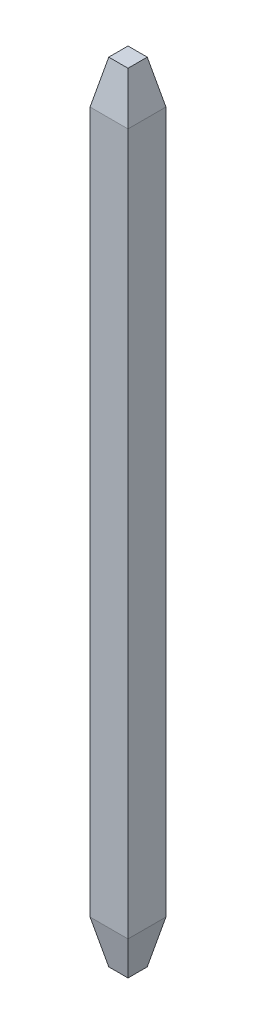
ISO-10303-21;
HEADER;
FILE_DESCRIPTION(('STEP AP214'),'2;1');
FILE_NAME('part.step','',(''),(''),'','','');
FILE_SCHEMA(('AUTOMOTIVE_DESIGN { 1 0 10303 214 1 1 1 1 }'));
ENDSEC;
DATA;
#1=APPLICATION_CONTEXT('core data for automotive mechanical design processes');
#2=APPLICATION_PROTOCOL_DEFINITION('international standard','automotive_design',2000,#1);
#3=PRODUCT_CONTEXT('',#1,'mechanical');
#4=PRODUCT('Part','Part','',(#3));
#5=PRODUCT_RELATED_PRODUCT_CATEGORY('part','',(#4));
#6=PRODUCT_DEFINITION_FORMATION('','',#4);
#7=PRODUCT_DEFINITION_CONTEXT('part definition',#1,'design');
#8=PRODUCT_DEFINITION('design','',#6,#7);
#9=PRODUCT_DEFINITION_SHAPE('','',#8);
#10=(LENGTH_UNIT() NAMED_UNIT(*) SI_UNIT(.MILLI.,.METRE.));
#11=(NAMED_UNIT(*) PLANE_ANGLE_UNIT() SI_UNIT($,.RADIAN.));
#12=(NAMED_UNIT(*) SI_UNIT($,.STERADIAN.) SOLID_ANGLE_UNIT());
#13=UNCERTAINTY_MEASURE_WITH_UNIT(LENGTH_MEASURE(1.E-05),#10,'distance_accuracy_value','');
#14=(GEOMETRIC_REPRESENTATION_CONTEXT(3) GLOBAL_UNCERTAINTY_ASSIGNED_CONTEXT((#13)) GLOBAL_UNIT_ASSIGNED_CONTEXT((#10,
#11,#12)) REPRESENTATION_CONTEXT('',''));
#15=CARTESIAN_POINT('',(0.,0.,0.));
#16=DIRECTION('',(0.,0.,1.));
#17=DIRECTION('',(1.,0.,0.));
#18=AXIS2_PLACEMENT_3D('',#15,#16,#17);
#19=CARTESIAN_POINT('',(0.,13.5,0.));
#20=DIRECTION('',(1.,0.,0.));
#21=DIRECTION('',(0.,0.,-1.));
#22=AXIS2_PLACEMENT_3D('',#19,#20,#21);
#23=PLANE('',#22);
#24=DIRECTION('',(0.,-1.,0.));
#25=VECTOR('',#24,1.);
#26=CARTESIAN_POINT('',(0.,13.5,-0.650000000000001));
#27=LINE('',#26,#25);
#28=CARTESIAN_POINT('',(0.,12.76,-0.650000000000001));
#29=VERTEX_POINT('',#28);
#30=CARTESIAN_POINT('',(0.,0.74000000000001,-0.650000000000001));
#31=VERTEX_POINT('',#30);
#32=EDGE_CURVE('E118',#29,#31,#27,.T.);
#33=ORIENTED_EDGE('',*,*,#32,.T.);
#34=DIRECTION('',(0.,0.,1.));
#35=VECTOR('',#34,1.);
#36=CARTESIAN_POINT('',(0.,0.740000000000012,0.));
#37=LINE('',#36,#35);
#38=CARTESIAN_POINT('',(0.,0.740000000000012,0.));
#39=VERTEX_POINT('',#38);
#40=EDGE_CURVE('E11',#31,#39,#37,.T.);
#41=ORIENTED_EDGE('',*,*,#40,.T.);
#42=DIRECTION('',(0.,-1.,0.));
#43=VECTOR('',#42,1.);
#44=CARTESIAN_POINT('',(0.,13.5,0.));
#45=LINE('',#44,#43);
#46=CARTESIAN_POINT('',(0.,12.76,0.));
#47=VERTEX_POINT('',#46);
#48=EDGE_CURVE('E124',#47,#39,#45,.T.);
#49=ORIENTED_EDGE('',*,*,#48,.F.);
#50=DIRECTION('',(0.,0.,-1.));
#51=VECTOR('',#50,1.);
#52=CARTESIAN_POINT('',(0.,12.76,0.));
#53=LINE('',#52,#51);
#54=EDGE_CURVE('E136',#47,#29,#53,.T.);
#55=ORIENTED_EDGE('',*,*,#54,.T.);
#56=EDGE_LOOP('',(#33,#41,#49,#55));
#57=FACE_BOUND('',#56,.T.);
#58=ADVANCED_FACE('F32',(#57),#23,.F.);
#59=CARTESIAN_POINT('',(0.,13.5,0.));
#60=DIRECTION('',(0.,0.,-1.));
#61=DIRECTION('',(-1.,0.,0.));
#62=AXIS2_PLACEMENT_3D('',#59,#60,#61);
#63=PLANE('',#62);
#64=ORIENTED_EDGE('',*,*,#48,.T.);
#65=DIRECTION('',(1.,0.,0.));
#66=VECTOR('',#65,1.);
#67=CARTESIAN_POINT('',(0.650000000000001,0.740000000000012,0.));
#68=LINE('',#67,#66);
#69=CARTESIAN_POINT('',(0.650000000000001,0.740000000000012,0.));
#70=VERTEX_POINT('',#69);
#71=EDGE_CURVE('E41',#39,#70,#68,.T.);
#72=ORIENTED_EDGE('',*,*,#71,.T.);
#73=DIRECTION('',(0.,-1.,0.));
#74=VECTOR('',#73,1.);
#75=CARTESIAN_POINT('',(0.650000000000001,13.5,0.));
#76=LINE('',#75,#74);
#77=CARTESIAN_POINT('',(0.650000000000001,12.76,0.));
#78=VERTEX_POINT('',#77);
#79=EDGE_CURVE('E126',#78,#70,#76,.T.);
#80=ORIENTED_EDGE('',*,*,#79,.F.);
#81=DIRECTION('',(-1.,0.,0.));
#82=VECTOR('',#81,1.);
#83=CARTESIAN_POINT('',(0.,12.76,0.));
#84=LINE('',#83,#82);
#85=EDGE_CURVE('E115',#78,#47,#84,.T.);
#86=ORIENTED_EDGE('',*,*,#85,.T.);
#87=EDGE_LOOP('',(#64,#72,#80,#86));
#88=FACE_BOUND('',#87,.T.);
#89=ADVANCED_FACE('F197',(#88),#63,.F.);
#90=CARTESIAN_POINT('',(0.650000000000001,13.5,0.));
#91=DIRECTION('',(-1.,0.,0.));
#92=DIRECTION('',(0.,0.,1.));
#93=AXIS2_PLACEMENT_3D('',#90,#91,#92);
#94=PLANE('',#93);
#95=ORIENTED_EDGE('',*,*,#79,.T.);
#96=DIRECTION('',(0.,0.,-1.));
#97=VECTOR('',#96,1.);
#98=CARTESIAN_POINT('',(0.650000000000001,0.740000000000012,-0.65));
#99=LINE('',#98,#97);
#100=CARTESIAN_POINT('',(0.650000000000001,0.740000000000012,-0.65));
#101=VERTEX_POINT('',#100);
#102=EDGE_CURVE('E157',#70,#101,#99,.T.);
#103=ORIENTED_EDGE('',*,*,#102,.T.);
#104=DIRECTION('',(0.,-1.,0.));
#105=VECTOR('',#104,1.);
#106=CARTESIAN_POINT('',(0.650000000000001,13.5,-0.65));
#107=LINE('',#106,#105);
#108=CARTESIAN_POINT('',(0.650000000000001,12.76,-0.65));
#109=VERTEX_POINT('',#108);
#110=EDGE_CURVE('E191',#109,#101,#107,.T.);
#111=ORIENTED_EDGE('',*,*,#110,.F.);
#112=DIRECTION('',(0.,0.,1.));
#113=VECTOR('',#112,1.);
#114=CARTESIAN_POINT('',(0.650000000000001,12.76,0.));
#115=LINE('',#114,#113);
#116=EDGE_CURVE('E139',#109,#78,#115,.T.);
#117=ORIENTED_EDGE('',*,*,#116,.T.);
#118=EDGE_LOOP('',(#95,#103,#111,#117));
#119=FACE_BOUND('',#118,.T.);
#120=ADVANCED_FACE('F196',(#119),#94,.F.);
#121=CARTESIAN_POINT('',(0.,13.5,-0.650000000000001));
#122=DIRECTION('',(0.,0.,1.));
#123=DIRECTION('',(1.,0.,0.));
#124=AXIS2_PLACEMENT_3D('',#121,#122,#123);
#125=PLANE('',#124);
#126=ORIENTED_EDGE('',*,*,#110,.T.);
#127=DIRECTION('',(-1.,0.,0.));
#128=VECTOR('',#127,1.);
#129=CARTESIAN_POINT('',(0.,0.740000000000012,-0.650000000000001));
#130=LINE('',#129,#128);
#131=EDGE_CURVE('E141',#101,#31,#130,.T.);
#132=ORIENTED_EDGE('',*,*,#131,.T.);
#133=ORIENTED_EDGE('',*,*,#32,.F.);
#134=DIRECTION('',(1.,0.,0.));
#135=VECTOR('',#134,1.);
#136=CARTESIAN_POINT('',(0.,12.76,-0.650000000000001));
#137=LINE('',#136,#135);
#138=EDGE_CURVE('E133',#29,#109,#137,.T.);
#139=ORIENTED_EDGE('',*,*,#138,.T.);
#140=EDGE_LOOP('',(#126,#132,#133,#139));
#141=FACE_BOUND('',#140,.T.);
#142=ADVANCED_FACE('F188',(#141),#125,.F.);
#143=CARTESIAN_POINT('',(0.,13.5,-0.650000000000001));
#144=DIRECTION('',(0.,-1.,0.));
#145=DIRECTION('',(0.,0.,-1.));
#146=AXIS2_PLACEMENT_3D('',#143,#144,#145);
#147=PLANE('',#146);
#148=DIRECTION('',(0.,0.,-1.));
#149=VECTOR('',#148,1.);
#150=CARTESIAN_POINT('',(0.490000000000001,13.5,-0.650000000000001));
#151=LINE('',#150,#149);
#152=CARTESIAN_POINT('',(0.490000000000001,13.5,-0.16));
#153=VERTEX_POINT('',#152);
#154=CARTESIAN_POINT('',(0.490000000000001,13.5,-0.49));
#155=VERTEX_POINT('',#154);
#156=EDGE_CURVE('E103',#153,#155,#151,.T.);
#157=ORIENTED_EDGE('',*,*,#156,.T.);
#158=DIRECTION('',(-1.,0.,0.));
#159=VECTOR('',#158,1.);
#160=CARTESIAN_POINT('',(0.,13.5,-0.490000000000001));
#161=LINE('',#160,#159);
#162=CARTESIAN_POINT('',(0.16,13.5,-0.490000000000001));
#163=VERTEX_POINT('',#162);
#164=EDGE_CURVE('E131',#155,#163,#161,.T.);
#165=ORIENTED_EDGE('',*,*,#164,.T.);
#166=DIRECTION('',(0.,0.,1.));
#167=VECTOR('',#166,1.);
#168=CARTESIAN_POINT('',(0.16,13.5,-0.650000000000001));
#169=LINE('',#168,#167);
#170=CARTESIAN_POINT('',(0.16,13.5,-0.16));
#171=VERTEX_POINT('',#170);
#172=EDGE_CURVE('E106',#163,#171,#169,.T.);
#173=ORIENTED_EDGE('',*,*,#172,.T.);
#174=DIRECTION('',(1.,0.,0.));
#175=VECTOR('',#174,1.);
#176=CARTESIAN_POINT('',(0.,13.5,-0.16));
#177=LINE('',#176,#175);
#178=EDGE_CURVE('E98',#171,#153,#177,.T.);
#179=ORIENTED_EDGE('',*,*,#178,.T.);
#180=EDGE_LOOP('',(#157,#165,#173,#179));
#181=FACE_BOUND('',#180,.T.);
#182=ADVANCED_FACE('F100',(#181),#147,.F.);
#183=CARTESIAN_POINT('',(0.,0.,-0.650000000000001));
#184=DIRECTION('',(0.,-1.,0.));
#185=DIRECTION('',(0.,0.,-1.));
#186=AXIS2_PLACEMENT_3D('',#183,#184,#185);
#187=PLANE('',#186);
#188=DIRECTION('',(0.,0.,-1.));
#189=VECTOR('',#188,1.);
#190=CARTESIAN_POINT('',(0.16,0.,-0.650000000000001));
#191=LINE('',#190,#189);
#192=CARTESIAN_POINT('',(0.16,0.,-0.16));
#193=VERTEX_POINT('',#192);
#194=CARTESIAN_POINT('',(0.16,0.,-0.490000000000001));
#195=VERTEX_POINT('',#194);
#196=EDGE_CURVE('E148',#193,#195,#191,.T.);
#197=ORIENTED_EDGE('',*,*,#196,.T.);
#198=DIRECTION('',(1.,0.,0.));
#199=VECTOR('',#198,1.);
#200=CARTESIAN_POINT('',(0.650000000000001,0.,-0.49));
#201=LINE('',#200,#199);
#202=CARTESIAN_POINT('',(0.490000000000001,0.,-0.49));
#203=VERTEX_POINT('',#202);
#204=EDGE_CURVE('E154',#195,#203,#201,.T.);
#205=ORIENTED_EDGE('',*,*,#204,.T.);
#206=DIRECTION('',(0.,0.,1.));
#207=VECTOR('',#206,1.);
#208=CARTESIAN_POINT('',(0.490000000000001,0.,0.));
#209=LINE('',#208,#207);
#210=CARTESIAN_POINT('',(0.490000000000001,0.,-0.16));
#211=VERTEX_POINT('',#210);
#212=EDGE_CURVE('E152',#203,#211,#209,.T.);
#213=ORIENTED_EDGE('',*,*,#212,.T.);
#214=DIRECTION('',(-1.,0.,0.));
#215=VECTOR('',#214,1.);
#216=CARTESIAN_POINT('',(0.,0.,-0.16));
#217=LINE('',#216,#215);
#218=EDGE_CURVE('E150',#211,#193,#217,.T.);
#219=ORIENTED_EDGE('',*,*,#218,.T.);
#220=EDGE_LOOP('',(#197,#205,#213,#219));
#221=FACE_BOUND('',#220,.T.);
#222=ADVANCED_FACE('F178',(#221),#187,.T.);
#223=CARTESIAN_POINT('',(0.,13.5,-0.16));
#224=DIRECTION('',(0.,-0.211332792527536,-0.977414165439868));
#225=DIRECTION('',(0.,0.977414165439868,-0.211332792527536));
#226=AXIS2_PLACEMENT_3D('',#223,#224,#225);
#227=PLANE('',#226);
#228=DIRECTION('',(-0.206765981265495,-0.956292663352927,0.206765981265495));
#229=VECTOR('',#228,1.);
#230=CARTESIAN_POINT('',(0.153159652638611,13.4683633934536,-0.153159652638611));
#231=LINE('',#230,#229);
#232=EDGE_CURVE('E119',#47,#171,#231,.F.);
#233=ORIENTED_EDGE('',*,*,#232,.F.);
#234=ORIENTED_EDGE('',*,*,#85,.F.);
#235=DIRECTION('',(0.206765981265495,-0.956292663352927,0.206765981265495));
#236=VECTOR('',#235,1.);
#237=CARTESIAN_POINT('',(0.469051436205746,13.5968871075484,-0.180948563794255));
#238=LINE('',#237,#236);
#239=EDGE_CURVE('E113',#153,#78,#238,.T.);
#240=ORIENTED_EDGE('',*,*,#239,.F.);
#241=ORIENTED_EDGE('',*,*,#178,.F.);
#242=EDGE_LOOP('',(#233,#234,#240,#241));
#243=FACE_BOUND('',#242,.T.);
#244=ADVANCED_FACE('F114',(#243),#227,.F.);
#245=CARTESIAN_POINT('',(0.490000000000001,13.5,-0.650000000000001));
#246=DIRECTION('',(-0.977414165439868,-0.211332792527536,0.));
#247=DIRECTION('',(0.211332792527536,-0.977414165439868,0.));
#248=AXIS2_PLACEMENT_3D('',#245,#246,#247);
#249=PLANE('',#248);
#250=ORIENTED_EDGE('',*,*,#239,.T.);
#251=ORIENTED_EDGE('',*,*,#116,.F.);
#252=DIRECTION('',(-0.206765981265495,0.956292663352927,0.206765981265495));
#253=VECTOR('',#252,1.);
#254=CARTESIAN_POINT('',(0.49684034736139,13.4683633934536,-0.496840347361389));
#255=LINE('',#254,#253);
#256=EDGE_CURVE('E122',#155,#109,#255,.F.);
#257=ORIENTED_EDGE('',*,*,#256,.F.);
#258=ORIENTED_EDGE('',*,*,#156,.F.);
#259=EDGE_LOOP('',(#250,#251,#257,#258));
#260=FACE_BOUND('',#259,.T.);
#261=ADVANCED_FACE('F121',(#260),#249,.F.);
#262=CARTESIAN_POINT('',(0.16,13.5,-0.650000000000001));
#263=DIRECTION('',(0.977414165439868,-0.211332792527536,0.));
#264=DIRECTION('',(0.211332792527536,0.977414165439868,0.));
#265=AXIS2_PLACEMENT_3D('',#262,#263,#264);
#266=PLANE('',#265);
#267=ORIENTED_EDGE('',*,*,#232,.T.);
#268=ORIENTED_EDGE('',*,*,#172,.F.);
#269=DIRECTION('',(-0.206765981265495,-0.956292663352927,-0.206765981265495));
#270=VECTOR('',#269,1.);
#271=CARTESIAN_POINT('',(0.153159652638611,13.4683633934536,-0.49684034736139));
#272=LINE('',#271,#270);
#273=EDGE_CURVE('E142',#29,#163,#272,.F.);
#274=ORIENTED_EDGE('',*,*,#273,.F.);
#275=ORIENTED_EDGE('',*,*,#54,.F.);
#276=EDGE_LOOP('',(#267,#268,#274,#275));
#277=FACE_BOUND('',#276,.T.);
#278=ADVANCED_FACE('F200',(#277),#266,.F.);
#279=CARTESIAN_POINT('',(0.,13.5,-0.490000000000001));
#280=DIRECTION('',(0.,-0.211332792527536,0.977414165439868));
#281=DIRECTION('',(0.,-0.977414165439868,-0.211332792527536));
#282=AXIS2_PLACEMENT_3D('',#279,#280,#281);
#283=PLANE('',#282);
#284=ORIENTED_EDGE('',*,*,#256,.T.);
#285=ORIENTED_EDGE('',*,*,#138,.F.);
#286=ORIENTED_EDGE('',*,*,#273,.T.);
#287=ORIENTED_EDGE('',*,*,#164,.F.);
#288=EDGE_LOOP('',(#284,#285,#286,#287));
#289=FACE_BOUND('',#288,.T.);
#290=ADVANCED_FACE('F202',(#289),#283,.F.);
#291=CARTESIAN_POINT('',(0.,0.740000000000012,0.));
#292=DIRECTION('',(0.,-0.211332792527536,0.977414165439868));
#293=DIRECTION('',(0.,-0.977414165439868,-0.211332792527536));
#294=AXIS2_PLACEMENT_3D('',#291,#292,#293);
#295=PLANE('',#294);
#296=DIRECTION('',(-0.206765981265494,0.956292663352927,0.206765981265494));
#297=VECTOR('',#296,1.);
#298=CARTESIAN_POINT('',(0.,0.740000000000012,0.));
#299=LINE('',#298,#297);
#300=EDGE_CURVE('E163',#193,#39,#299,.T.);
#301=ORIENTED_EDGE('',*,*,#300,.F.);
#302=ORIENTED_EDGE('',*,*,#218,.F.);
#303=DIRECTION('',(0.206765981265494,0.956292663352927,0.206765981265494));
#304=VECTOR('',#303,1.);
#305=CARTESIAN_POINT('',(0.622211088844357,0.611476285905157,-0.0277889111556439));
#306=LINE('',#305,#304);
#307=EDGE_CURVE('E36',#70,#211,#306,.F.);
#308=ORIENTED_EDGE('',*,*,#307,.F.);
#309=ORIENTED_EDGE('',*,*,#71,.F.);
#310=EDGE_LOOP('',(#301,#302,#308,#309));
#311=FACE_BOUND('',#310,.T.);
#312=ADVANCED_FACE('F34',(#311),#295,.T.);
#313=CARTESIAN_POINT('',(0.650000000000001,0.740000000000012,0.));
#314=DIRECTION('',(0.977414165439868,-0.211332792527536,0.));
#315=DIRECTION('',(0.211332792527536,0.977414165439868,0.));
#316=AXIS2_PLACEMENT_3D('',#313,#314,#315);
#317=PLANE('',#316);
#318=ORIENTED_EDGE('',*,*,#307,.T.);
#319=ORIENTED_EDGE('',*,*,#212,.F.);
#320=DIRECTION('',(0.206765981265494,0.956292663352927,-0.206765981265494));
#321=VECTOR('',#320,1.);
#322=CARTESIAN_POINT('',(0.622211088844358,0.611476285905157,-0.622211088844356));
#323=LINE('',#322,#321);
#324=EDGE_CURVE('E162',#101,#203,#323,.F.);
#325=ORIENTED_EDGE('',*,*,#324,.F.);
#326=ORIENTED_EDGE('',*,*,#102,.F.);
#327=EDGE_LOOP('',(#318,#319,#325,#326));
#328=FACE_BOUND('',#327,.T.);
#329=ADVANCED_FACE('F173',(#328),#317,.T.);
#330=CARTESIAN_POINT('',(0.,0.740000000000012,0.));
#331=DIRECTION('',(-0.977414165439868,-0.211332792527536,0.));
#332=DIRECTION('',(0.211332792527536,-0.977414165439868,0.));
#333=AXIS2_PLACEMENT_3D('',#330,#331,#332);
#334=PLANE('',#333);
#335=ORIENTED_EDGE('',*,*,#300,.T.);
#336=ORIENTED_EDGE('',*,*,#40,.F.);
#337=DIRECTION('',(0.206765981265494,-0.956292663352927,0.206765981265495));
#338=VECTOR('',#337,1.);
#339=CARTESIAN_POINT('',(0.0277889111556439,0.611476285905156,-0.622211088844357));
#340=LINE('',#339,#338);
#341=EDGE_CURVE('E160',#195,#31,#340,.F.);
#342=ORIENTED_EDGE('',*,*,#341,.F.);
#343=ORIENTED_EDGE('',*,*,#196,.F.);
#344=EDGE_LOOP('',(#335,#336,#342,#343));
#345=FACE_BOUND('',#344,.T.);
#346=ADVANCED_FACE('F184',(#345),#334,.T.);
#347=CARTESIAN_POINT('',(0.,0.740000000000012,-0.650000000000001));
#348=DIRECTION('',(0.,-0.211332792527536,-0.977414165439868));
#349=DIRECTION('',(0.,0.977414165439868,-0.211332792527536));
#350=AXIS2_PLACEMENT_3D('',#347,#348,#349);
#351=PLANE('',#350);
#352=ORIENTED_EDGE('',*,*,#324,.T.);
#353=ORIENTED_EDGE('',*,*,#204,.F.);
#354=ORIENTED_EDGE('',*,*,#341,.T.);
#355=ORIENTED_EDGE('',*,*,#131,.F.);
#356=EDGE_LOOP('',(#352,#353,#354,#355));
#357=FACE_BOUND('',#356,.T.);
#358=ADVANCED_FACE('F182',(#357),#351,.T.);
#359=CLOSED_SHELL('',(#58,#89,#120,#142,#182,#222,#244,#261,#278,#290,#312,#329,#346,#358));
#360=MANIFOLD_SOLID_BREP('B2',#359);
#361=ADVANCED_BREP_SHAPE_REPRESENTATION('',(#18,#360),#14);
#362=SHAPE_DEFINITION_REPRESENTATION(#9,#361);
ENDSEC;
END-ISO-10303-21;
